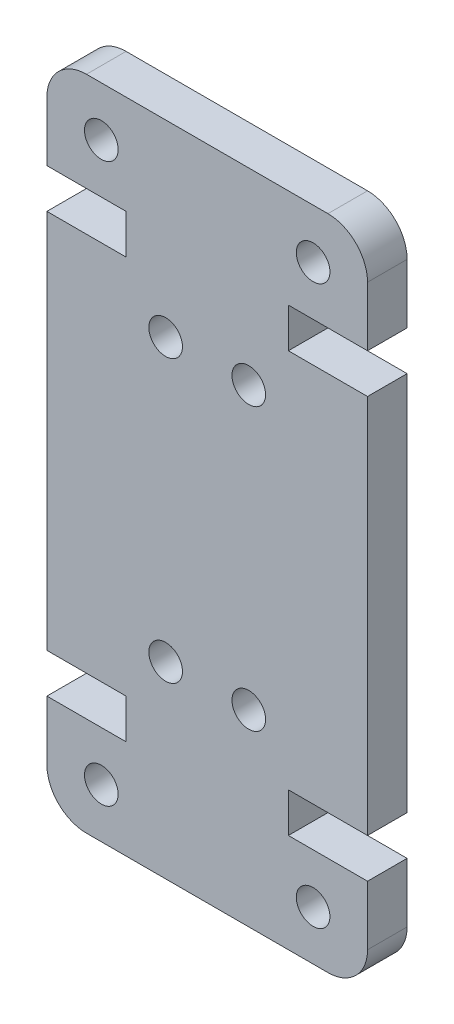
ISO-10303-21;
HEADER;
FILE_DESCRIPTION(('STEP AP214'),'2;1');
FILE_NAME('part.step','',(''),(''),'','','');
FILE_SCHEMA(('AUTOMOTIVE_DESIGN { 1 0 10303 214 1 1 1 1 }'));
ENDSEC;
DATA;
#1=APPLICATION_CONTEXT('core data for automotive mechanical design processes');
#2=APPLICATION_PROTOCOL_DEFINITION('international standard','automotive_design',2000,#1);
#3=PRODUCT_CONTEXT('',#1,'mechanical');
#4=PRODUCT('Part','Part','',(#3));
#5=PRODUCT_RELATED_PRODUCT_CATEGORY('part','',(#4));
#6=PRODUCT_DEFINITION_FORMATION('','',#4);
#7=PRODUCT_DEFINITION_CONTEXT('part definition',#1,'design');
#8=PRODUCT_DEFINITION('design','',#6,#7);
#9=PRODUCT_DEFINITION_SHAPE('','',#8);
#10=(LENGTH_UNIT() NAMED_UNIT(*) SI_UNIT(.MILLI.,.METRE.));
#11=(NAMED_UNIT(*) PLANE_ANGLE_UNIT() SI_UNIT($,.RADIAN.));
#12=(NAMED_UNIT(*) SI_UNIT($,.STERADIAN.) SOLID_ANGLE_UNIT());
#13=UNCERTAINTY_MEASURE_WITH_UNIT(LENGTH_MEASURE(1.E-05),#10,'distance_accuracy_value','');
#14=(GEOMETRIC_REPRESENTATION_CONTEXT(3) GLOBAL_UNCERTAINTY_ASSIGNED_CONTEXT((#13)) GLOBAL_UNIT_ASSIGNED_CONTEXT((#10,
#11,#12)) REPRESENTATION_CONTEXT('',''));
#15=CARTESIAN_POINT('',(0.,0.,0.));
#16=DIRECTION('',(0.,0.,1.));
#17=DIRECTION('',(1.,0.,0.));
#18=AXIS2_PLACEMENT_3D('',#15,#16,#17);
#19=CARTESIAN_POINT('',(2.00000000000001,2.,4.));
#20=DIRECTION('',(0.,0.,1.));
#21=DIRECTION('',(1.,0.,0.));
#22=AXIS2_PLACEMENT_3D('',#19,#20,#21);
#23=PLANE('',#22);
#24=CARTESIAN_POINT('',(10.2,23.7100000000004,4.));
#25=DIRECTION('',(0.,0.,1.));
#26=DIRECTION('',(1.,0.,0.));
#27=AXIS2_PLACEMENT_3D('',#24,#25,#26);
#28=CIRCLE('',#27,0.85);
#29=CARTESIAN_POINT('',(11.05,23.7100000000004,4.));
#30=VERTEX_POINT('',#29);
#31=EDGE_CURVE('E298',#30,#30,#28,.T.);
#32=ORIENTED_EDGE('',*,*,#31,.F.);
#33=EDGE_LOOP('',(#32));
#34=FACE_BOUND('',#33,.T.);
#35=CARTESIAN_POINT('',(6.,9.49999999999962,4.));
#36=DIRECTION('',(0.,0.,1.));
#37=DIRECTION('',(1.,0.,0.));
#38=AXIS2_PLACEMENT_3D('',#35,#36,#37);
#39=CIRCLE('',#38,0.85);
#40=CARTESIAN_POINT('',(6.85,9.49999999999962,4.));
#41=VERTEX_POINT('',#40);
#42=EDGE_CURVE('E304',#41,#41,#39,.T.);
#43=ORIENTED_EDGE('',*,*,#42,.F.);
#44=EDGE_LOOP('',(#43));
#45=FACE_BOUND('',#44,.T.);
#46=CARTESIAN_POINT('',(2.75000000000003,30.7099999999998,4.));
#47=DIRECTION('',(0.,0.,1.));
#48=DIRECTION('',(-1.,0.,0.));
#49=AXIS2_PLACEMENT_3D('',#46,#47,#48);
#50=CIRCLE('',#49,0.85);
#51=CARTESIAN_POINT('',(1.90000000000003,30.7099999999998,4.));
#52=VERTEX_POINT('',#51);
#53=EDGE_CURVE('E310',#52,#52,#50,.T.);
#54=ORIENTED_EDGE('',*,*,#53,.F.);
#55=EDGE_LOOP('',(#54));
#56=FACE_BOUND('',#55,.T.);
#57=CARTESIAN_POINT('',(13.45,2.50000000000017,4.));
#58=DIRECTION('',(0.,0.,1.));
#59=DIRECTION('',(-1.,0.,0.));
#60=AXIS2_PLACEMENT_3D('',#57,#58,#59);
#61=CIRCLE('',#60,0.85);
#62=CARTESIAN_POINT('',(12.6,2.50000000000017,4.));
#63=VERTEX_POINT('',#62);
#64=EDGE_CURVE('E316',#63,#63,#61,.T.);
#65=ORIENTED_EDGE('',*,*,#64,.F.);
#66=EDGE_LOOP('',(#65));
#67=FACE_BOUND('',#66,.T.);
#68=DIRECTION('',(1.,0.,0.));
#69=VECTOR('',#68,1.);
#70=CARTESIAN_POINT('',(0.,6.99999999999946,4.));
#71=LINE('',#70,#69);
#72=CARTESIAN_POINT('',(0.,6.99999999999946,4.));
#73=VERTEX_POINT('',#72);
#74=CARTESIAN_POINT('',(4.00000000000001,6.99999999999946,4.));
#75=VERTEX_POINT('',#74);
#76=EDGE_CURVE('E319',#73,#75,#71,.T.);
#77=ORIENTED_EDGE('',*,*,#76,.T.);
#78=DIRECTION('',(0.,-1.,0.));
#79=VECTOR('',#78,1.);
#80=CARTESIAN_POINT('',(4.00000000000001,6.99999999999946,4.));
#81=LINE('',#80,#79);
#82=CARTESIAN_POINT('',(4.,4.99999999999945,4.));
#83=VERTEX_POINT('',#82);
#84=EDGE_CURVE('E286',#75,#83,#81,.T.);
#85=ORIENTED_EDGE('',*,*,#84,.T.);
#86=DIRECTION('',(-1.,0.,0.));
#87=VECTOR('',#86,1.);
#88=CARTESIAN_POINT('',(4.,4.99999999999945,4.));
#89=LINE('',#88,#87);
#90=CARTESIAN_POINT('',(0.,4.99999999999945,4.));
#91=VERTEX_POINT('',#90);
#92=EDGE_CURVE('E282',#83,#91,#89,.T.);
#93=ORIENTED_EDGE('',*,*,#92,.T.);
#94=DIRECTION('',(0.,-1.,0.));
#95=VECTOR('',#94,1.);
#96=CARTESIAN_POINT('',(0.,2.,4.));
#97=LINE('',#96,#95);
#98=CARTESIAN_POINT('',(0.,2.,4.));
#99=VERTEX_POINT('',#98);
#100=EDGE_CURVE('E323',#91,#99,#97,.T.);
#101=ORIENTED_EDGE('',*,*,#100,.T.);
#102=CARTESIAN_POINT('',(2.00000000000001,2.,4.));
#103=DIRECTION('',(0.,0.,1.));
#104=DIRECTION('',(1.,0.,0.));
#105=AXIS2_PLACEMENT_3D('',#102,#103,#104);
#106=CIRCLE('',#105,2.00000000000001);
#107=CARTESIAN_POINT('',(2.00000000000001,0.,4.));
#108=VERTEX_POINT('',#107);
#109=EDGE_CURVE('E325',#99,#108,#106,.T.);
#110=ORIENTED_EDGE('',*,*,#109,.T.);
#111=DIRECTION('',(1.,0.,0.));
#112=VECTOR('',#111,1.);
#113=CARTESIAN_POINT('',(2.00000000000001,0.,4.));
#114=LINE('',#113,#112);
#115=CARTESIAN_POINT('',(14.2,0.,4.));
#116=VERTEX_POINT('',#115);
#117=EDGE_CURVE('E327',#108,#116,#114,.T.);
#118=ORIENTED_EDGE('',*,*,#117,.T.);
#119=CARTESIAN_POINT('',(14.2,2.,4.));
#120=DIRECTION('',(0.,0.,1.));
#121=DIRECTION('',(-1.,0.,0.));
#122=AXIS2_PLACEMENT_3D('',#119,#120,#121);
#123=CIRCLE('',#122,2.);
#124=CARTESIAN_POINT('',(16.2,2.,4.));
#125=VERTEX_POINT('',#124);
#126=EDGE_CURVE('E329',#116,#125,#123,.T.);
#127=ORIENTED_EDGE('',*,*,#126,.T.);
#128=DIRECTION('',(0.,1.,0.));
#129=VECTOR('',#128,1.);
#130=CARTESIAN_POINT('',(16.2,2.,4.));
#131=LINE('',#130,#129);
#132=CARTESIAN_POINT('',(16.2,4.99999999999945,4.));
#133=VERTEX_POINT('',#132);
#134=EDGE_CURVE('E331',#125,#133,#131,.T.);
#135=ORIENTED_EDGE('',*,*,#134,.T.);
#136=DIRECTION('',(-1.,0.,0.));
#137=VECTOR('',#136,1.);
#138=CARTESIAN_POINT('',(12.2,4.99999999999945,4.));
#139=LINE('',#138,#137);
#140=CARTESIAN_POINT('',(12.2,4.99999999999945,4.));
#141=VERTEX_POINT('',#140);
#142=EDGE_CURVE('E333',#133,#141,#139,.T.);
#143=ORIENTED_EDGE('',*,*,#142,.T.);
#144=DIRECTION('',(0.,1.,0.));
#145=VECTOR('',#144,1.);
#146=CARTESIAN_POINT('',(12.2,6.99999999999945,4.));
#147=LINE('',#146,#145);
#148=CARTESIAN_POINT('',(12.2,6.99999999999945,4.));
#149=VERTEX_POINT('',#148);
#150=EDGE_CURVE('E335',#141,#149,#147,.T.);
#151=ORIENTED_EDGE('',*,*,#150,.T.);
#152=DIRECTION('',(1.,0.,0.));
#153=VECTOR('',#152,1.);
#154=CARTESIAN_POINT('',(16.2,6.99999999999945,4.));
#155=LINE('',#154,#153);
#156=CARTESIAN_POINT('',(16.2,6.99999999999945,4.));
#157=VERTEX_POINT('',#156);
#158=EDGE_CURVE('E337',#149,#157,#155,.T.);
#159=ORIENTED_EDGE('',*,*,#158,.T.);
#160=DIRECTION('',(0.,1.,0.));
#161=VECTOR('',#160,1.);
#162=CARTESIAN_POINT('',(16.2,26.2100000000006,4.));
#163=LINE('',#162,#161);
#164=CARTESIAN_POINT('',(16.2,26.2100000000006,4.));
#165=VERTEX_POINT('',#164);
#166=EDGE_CURVE('E339',#157,#165,#163,.T.);
#167=ORIENTED_EDGE('',*,*,#166,.T.);
#168=DIRECTION('',(-1.,0.,0.));
#169=VECTOR('',#168,1.);
#170=CARTESIAN_POINT('',(16.2,26.2100000000006,4.));
#171=LINE('',#170,#169);
#172=CARTESIAN_POINT('',(12.2,26.2100000000006,4.));
#173=VERTEX_POINT('',#172);
#174=EDGE_CURVE('E341',#165,#173,#171,.T.);
#175=ORIENTED_EDGE('',*,*,#174,.T.);
#176=DIRECTION('',(0.,1.,0.));
#177=VECTOR('',#176,1.);
#178=CARTESIAN_POINT('',(12.2,26.2100000000006,4.));
#179=LINE('',#178,#177);
#180=CARTESIAN_POINT('',(12.2,28.2100000000006,4.));
#181=VERTEX_POINT('',#180);
#182=EDGE_CURVE('E343',#173,#181,#179,.T.);
#183=ORIENTED_EDGE('',*,*,#182,.T.);
#184=DIRECTION('',(1.,0.,0.));
#185=VECTOR('',#184,1.);
#186=CARTESIAN_POINT('',(12.2,28.2100000000006,4.));
#187=LINE('',#186,#185);
#188=CARTESIAN_POINT('',(16.2,28.2100000000006,4.));
#189=VERTEX_POINT('',#188);
#190=EDGE_CURVE('E345',#181,#189,#187,.T.);
#191=ORIENTED_EDGE('',*,*,#190,.T.);
#192=DIRECTION('',(0.,1.,0.));
#193=VECTOR('',#192,1.);
#194=CARTESIAN_POINT('',(16.2,31.21,4.));
#195=LINE('',#194,#193);
#196=CARTESIAN_POINT('',(16.2,31.21,4.));
#197=VERTEX_POINT('',#196);
#198=EDGE_CURVE('E347',#189,#197,#195,.T.);
#199=ORIENTED_EDGE('',*,*,#198,.T.);
#200=CARTESIAN_POINT('',(14.2,31.21,4.));
#201=DIRECTION('',(0.,0.,1.));
#202=DIRECTION('',(1.,0.,0.));
#203=AXIS2_PLACEMENT_3D('',#200,#201,#202);
#204=CIRCLE('',#203,2.);
#205=CARTESIAN_POINT('',(14.2,33.21,4.));
#206=VERTEX_POINT('',#205);
#207=EDGE_CURVE('E349',#197,#206,#204,.T.);
#208=ORIENTED_EDGE('',*,*,#207,.T.);
#209=DIRECTION('',(-1.,0.,0.));
#210=VECTOR('',#209,1.);
#211=CARTESIAN_POINT('',(1.99999999999999,33.21,4.));
#212=LINE('',#211,#210);
#213=CARTESIAN_POINT('',(1.99999999999999,33.21,4.));
#214=VERTEX_POINT('',#213);
#215=EDGE_CURVE('E351',#206,#214,#212,.T.);
#216=ORIENTED_EDGE('',*,*,#215,.T.);
#217=CARTESIAN_POINT('',(1.99999999999999,31.21,4.));
#218=DIRECTION('',(0.,0.,1.));
#219=DIRECTION('',(-1.,0.,0.));
#220=AXIS2_PLACEMENT_3D('',#217,#218,#219);
#221=CIRCLE('',#220,2.);
#222=CARTESIAN_POINT('',(0.,31.21,4.));
#223=VERTEX_POINT('',#222);
#224=EDGE_CURVE('E353',#214,#223,#221,.T.);
#225=ORIENTED_EDGE('',*,*,#224,.T.);
#226=DIRECTION('',(0.,-1.,0.));
#227=VECTOR('',#226,1.);
#228=CARTESIAN_POINT('',(0.,31.21,4.));
#229=LINE('',#228,#227);
#230=CARTESIAN_POINT('',(0.,28.2100000000006,4.));
#231=VERTEX_POINT('',#230);
#232=EDGE_CURVE('E221',#223,#231,#229,.T.);
#233=ORIENTED_EDGE('',*,*,#232,.T.);
#234=DIRECTION('',(1.,0.,0.));
#235=VECTOR('',#234,1.);
#236=CARTESIAN_POINT('',(3.99999999999999,28.2100000000006,4.));
#237=LINE('',#236,#235);
#238=CARTESIAN_POINT('',(3.99999999999999,28.2100000000006,4.));
#239=VERTEX_POINT('',#238);
#240=EDGE_CURVE('E356',#231,#239,#237,.T.);
#241=ORIENTED_EDGE('',*,*,#240,.T.);
#242=DIRECTION('',(0.,-1.,0.));
#243=VECTOR('',#242,1.);
#244=CARTESIAN_POINT('',(3.99999999999999,26.2100000000006,4.));
#245=LINE('',#244,#243);
#246=CARTESIAN_POINT('',(3.99999999999999,26.2100000000006,4.));
#247=VERTEX_POINT('',#246);
#248=EDGE_CURVE('E358',#239,#247,#245,.T.);
#249=ORIENTED_EDGE('',*,*,#248,.T.);
#250=DIRECTION('',(-1.,0.,0.));
#251=VECTOR('',#250,1.);
#252=CARTESIAN_POINT('',(0.,26.2100000000005,4.));
#253=LINE('',#252,#251);
#254=CARTESIAN_POINT('',(0.,26.2100000000005,4.));
#255=VERTEX_POINT('',#254);
#256=EDGE_CURVE('E360',#247,#255,#253,.T.);
#257=ORIENTED_EDGE('',*,*,#256,.T.);
#258=DIRECTION('',(0.,-1.,0.));
#259=VECTOR('',#258,1.);
#260=CARTESIAN_POINT('',(0.,26.2100000000005,4.));
#261=LINE('',#260,#259);
#262=EDGE_CURVE('E57',#255,#73,#261,.T.);
#263=ORIENTED_EDGE('',*,*,#262,.T.);
#264=EDGE_LOOP('',(#77,#85,#93,#101,#110,#118,#127,#135,#143,#151,#159,#167,#175,#183,#191,#199,
#208,#216,#225,#233,#241,#249,#257,#263));
#265=FACE_BOUND('',#264,.T.);
#266=CARTESIAN_POINT('',(10.2,9.49999999999962,4.));
#267=DIRECTION('',(0.,0.,1.));
#268=DIRECTION('',(-1.,0.,0.));
#269=AXIS2_PLACEMENT_3D('',#266,#267,#268);
#270=CIRCLE('',#269,0.85);
#271=CARTESIAN_POINT('',(9.35,9.49999999999962,4.));
#272=VERTEX_POINT('',#271);
#273=EDGE_CURVE('E313',#272,#272,#270,.T.);
#274=ORIENTED_EDGE('',*,*,#273,.F.);
#275=EDGE_LOOP('',(#274));
#276=FACE_BOUND('',#275,.T.);
#277=CARTESIAN_POINT('',(5.99999999999999,23.7100000000004,4.));
#278=DIRECTION('',(0.,0.,1.));
#279=DIRECTION('',(-1.,0.,0.));
#280=AXIS2_PLACEMENT_3D('',#277,#278,#279);
#281=CIRCLE('',#280,0.85);
#282=CARTESIAN_POINT('',(5.15,23.7100000000004,4.));
#283=VERTEX_POINT('',#282);
#284=EDGE_CURVE('E307',#283,#283,#281,.T.);
#285=ORIENTED_EDGE('',*,*,#284,.F.);
#286=EDGE_LOOP('',(#285));
#287=FACE_BOUND('',#286,.T.);
#288=CARTESIAN_POINT('',(2.75000000000004,2.50000000000017,4.));
#289=DIRECTION('',(0.,0.,1.));
#290=DIRECTION('',(1.,0.,0.));
#291=AXIS2_PLACEMENT_3D('',#288,#289,#290);
#292=CIRCLE('',#291,0.85);
#293=CARTESIAN_POINT('',(3.60000000000004,2.50000000000017,4.));
#294=VERTEX_POINT('',#293);
#295=EDGE_CURVE('E301',#294,#294,#292,.T.);
#296=ORIENTED_EDGE('',*,*,#295,.F.);
#297=EDGE_LOOP('',(#296));
#298=FACE_BOUND('',#297,.T.);
#299=CARTESIAN_POINT('',(13.45,30.7099999999998,4.));
#300=DIRECTION('',(0.,0.,1.));
#301=DIRECTION('',(1.,0.,0.));
#302=AXIS2_PLACEMENT_3D('',#299,#300,#301);
#303=CIRCLE('',#302,0.85);
#304=CARTESIAN_POINT('',(14.3,30.7099999999998,4.));
#305=VERTEX_POINT('',#304);
#306=EDGE_CURVE('E290',#305,#305,#303,.T.);
#307=ORIENTED_EDGE('',*,*,#306,.F.);
#308=EDGE_LOOP('',(#307));
#309=FACE_BOUND('',#308,.T.);
#310=ADVANCED_FACE('F33',(#34,#45,#56,#67,#265,#276,#287,#298,#309),#23,.T.);
#311=CARTESIAN_POINT('',(0.,6.99999999999946,4.));
#312=DIRECTION('',(0.,1.,0.));
#313=DIRECTION('',(0.,0.,1.));
#314=AXIS2_PLACEMENT_3D('',#311,#312,#313);
#315=PLANE('',#314);
#316=DIRECTION('',(0.,0.,-1.));
#317=VECTOR('',#316,1.);
#318=CARTESIAN_POINT('',(0.,6.99999999999946,4.));
#319=LINE('',#318,#317);
#320=CARTESIAN_POINT('',(0.,6.99999999999946,2.));
#321=VERTEX_POINT('',#320);
#322=EDGE_CURVE('E363',#73,#321,#319,.T.);
#323=ORIENTED_EDGE('',*,*,#322,.T.);
#324=DIRECTION('',(1.,0.,0.));
#325=VECTOR('',#324,1.);
#326=CARTESIAN_POINT('',(0.,6.99999999999946,2.));
#327=LINE('',#326,#325);
#328=CARTESIAN_POINT('',(4.00000000000001,6.99999999999946,2.));
#329=VERTEX_POINT('',#328);
#330=EDGE_CURVE('E49',#321,#329,#327,.T.);
#331=ORIENTED_EDGE('',*,*,#330,.T.);
#332=DIRECTION('',(0.,0.,-1.));
#333=VECTOR('',#332,1.);
#334=CARTESIAN_POINT('',(4.00000000000001,6.99999999999946,4.));
#335=LINE('',#334,#333);
#336=EDGE_CURVE('E11',#75,#329,#335,.T.);
#337=ORIENTED_EDGE('',*,*,#336,.F.);
#338=ORIENTED_EDGE('',*,*,#76,.F.);
#339=EDGE_LOOP('',(#323,#331,#337,#338));
#340=FACE_BOUND('',#339,.T.);
#341=ADVANCED_FACE('F35',(#340),#315,.F.);
#342=CARTESIAN_POINT('',(4.00000000000001,6.99999999999946,4.));
#343=DIRECTION('',(1.,0.,0.));
#344=DIRECTION('',(0.,1.,0.));
#345=AXIS2_PLACEMENT_3D('',#342,#343,#344);
#346=PLANE('',#345);
#347=ORIENTED_EDGE('',*,*,#336,.T.);
#348=DIRECTION('',(0.,-1.,0.));
#349=VECTOR('',#348,1.);
#350=CARTESIAN_POINT('',(4.00000000000001,6.99999999999946,2.));
#351=LINE('',#350,#349);
#352=CARTESIAN_POINT('',(4.,4.99999999999945,2.));
#353=VERTEX_POINT('',#352);
#354=EDGE_CURVE('E287',#329,#353,#351,.T.);
#355=ORIENTED_EDGE('',*,*,#354,.T.);
#356=DIRECTION('',(0.,0.,-1.));
#357=VECTOR('',#356,1.);
#358=CARTESIAN_POINT('',(4.,4.99999999999945,4.));
#359=LINE('',#358,#357);
#360=EDGE_CURVE('E42',#83,#353,#359,.T.);
#361=ORIENTED_EDGE('',*,*,#360,.F.);
#362=ORIENTED_EDGE('',*,*,#84,.F.);
#363=EDGE_LOOP('',(#347,#355,#361,#362));
#364=FACE_BOUND('',#363,.T.);
#365=ADVANCED_FACE('F285',(#364),#346,.F.);
#366=CARTESIAN_POINT('',(4.,4.99999999999945,4.));
#367=DIRECTION('',(0.,-1.,0.));
#368=DIRECTION('',(0.,0.,-1.));
#369=AXIS2_PLACEMENT_3D('',#366,#367,#368);
#370=PLANE('',#369);
#371=ORIENTED_EDGE('',*,*,#360,.T.);
#372=DIRECTION('',(-1.,0.,0.));
#373=VECTOR('',#372,1.);
#374=CARTESIAN_POINT('',(4.,4.99999999999945,2.));
#375=LINE('',#374,#373);
#376=CARTESIAN_POINT('',(0.,4.99999999999945,2.));
#377=VERTEX_POINT('',#376);
#378=EDGE_CURVE('E281',#353,#377,#375,.T.);
#379=ORIENTED_EDGE('',*,*,#378,.T.);
#380=DIRECTION('',(0.,0.,-1.));
#381=VECTOR('',#380,1.);
#382=CARTESIAN_POINT('',(0.,4.99999999999945,4.));
#383=LINE('',#382,#381);
#384=EDGE_CURVE('E271',#91,#377,#383,.T.);
#385=ORIENTED_EDGE('',*,*,#384,.F.);
#386=ORIENTED_EDGE('',*,*,#92,.F.);
#387=EDGE_LOOP('',(#371,#379,#385,#386));
#388=FACE_BOUND('',#387,.T.);
#389=ADVANCED_FACE('F279',(#388),#370,.F.);
#390=CARTESIAN_POINT('',(0.,2.,4.));
#391=DIRECTION('',(1.,0.,0.));
#392=DIRECTION('',(0.,0.,-1.));
#393=AXIS2_PLACEMENT_3D('',#390,#391,#392);
#394=PLANE('',#393);
#395=ORIENTED_EDGE('',*,*,#384,.T.);
#396=DIRECTION('',(0.,-1.,0.));
#397=VECTOR('',#396,1.);
#398=CARTESIAN_POINT('',(0.,33.21,2.));
#399=LINE('',#398,#397);
#400=CARTESIAN_POINT('',(0.,2.,2.));
#401=VERTEX_POINT('',#400);
#402=EDGE_CURVE('E208',#377,#401,#399,.T.);
#403=ORIENTED_EDGE('',*,*,#402,.T.);
#404=DIRECTION('',(0.,0.,-1.));
#405=VECTOR('',#404,1.);
#406=CARTESIAN_POINT('',(0.,2.,4.));
#407=LINE('',#406,#405);
#408=EDGE_CURVE('E268',#99,#401,#407,.T.);
#409=ORIENTED_EDGE('',*,*,#408,.F.);
#410=ORIENTED_EDGE('',*,*,#100,.F.);
#411=EDGE_LOOP('',(#395,#403,#409,#410));
#412=FACE_BOUND('',#411,.T.);
#413=ADVANCED_FACE('F426',(#412),#394,.F.);
#414=CARTESIAN_POINT('',(2.00000000000001,2.,4.));
#415=DIRECTION('',(0.,0.,-1.));
#416=DIRECTION('',(-1.,0.,0.));
#417=AXIS2_PLACEMENT_3D('',#414,#415,#416);
#418=CYLINDRICAL_SURFACE('',#417,2.00000000000001);
#419=ORIENTED_EDGE('',*,*,#408,.T.);
#420=CARTESIAN_POINT('',(2.00000000000001,2.,2.));
#421=DIRECTION('',(0.,0.,1.));
#422=DIRECTION('',(1.,0.,0.));
#423=AXIS2_PLACEMENT_3D('',#420,#421,#422);
#424=CIRCLE('',#423,2.00000000000001);
#425=CARTESIAN_POINT('',(2.00000000000001,0.,2.));
#426=VERTEX_POINT('',#425);
#427=EDGE_CURVE('E292',#401,#426,#424,.T.);
#428=ORIENTED_EDGE('',*,*,#427,.T.);
#429=DIRECTION('',(0.,0.,-1.));
#430=VECTOR('',#429,1.);
#431=CARTESIAN_POINT('',(2.00000000000001,0.,4.));
#432=LINE('',#431,#430);
#433=EDGE_CURVE('E265',#108,#426,#432,.T.);
#434=ORIENTED_EDGE('',*,*,#433,.F.);
#435=ORIENTED_EDGE('',*,*,#109,.F.);
#436=EDGE_LOOP('',(#419,#428,#434,#435));
#437=FACE_BOUND('',#436,.T.);
#438=ADVANCED_FACE('F412',(#437),#418,.T.);
#439=CARTESIAN_POINT('',(2.00000000000001,0.,4.));
#440=DIRECTION('',(0.,1.,0.));
#441=DIRECTION('',(-1.,0.,0.));
#442=AXIS2_PLACEMENT_3D('',#439,#440,#441);
#443=PLANE('',#442);
#444=ORIENTED_EDGE('',*,*,#433,.T.);
#445=DIRECTION('',(1.,0.,0.));
#446=VECTOR('',#445,1.);
#447=CARTESIAN_POINT('',(0.,0.,2.));
#448=LINE('',#447,#446);
#449=CARTESIAN_POINT('',(14.2,0.,2.));
#450=VERTEX_POINT('',#449);
#451=EDGE_CURVE('E205',#426,#450,#448,.T.);
#452=ORIENTED_EDGE('',*,*,#451,.T.);
#453=DIRECTION('',(0.,0.,-1.));
#454=VECTOR('',#453,1.);
#455=CARTESIAN_POINT('',(14.2,0.,4.));
#456=LINE('',#455,#454);
#457=EDGE_CURVE('E262',#116,#450,#456,.T.);
#458=ORIENTED_EDGE('',*,*,#457,.F.);
#459=ORIENTED_EDGE('',*,*,#117,.F.);
#460=EDGE_LOOP('',(#444,#452,#458,#459));
#461=FACE_BOUND('',#460,.T.);
#462=ADVANCED_FACE('F419',(#461),#443,.F.);
#463=CARTESIAN_POINT('',(14.2,2.,4.));
#464=DIRECTION('',(0.,0.,-1.));
#465=DIRECTION('',(-1.,0.,0.));
#466=AXIS2_PLACEMENT_3D('',#463,#464,#465);
#467=CYLINDRICAL_SURFACE('',#466,2.);
#468=ORIENTED_EDGE('',*,*,#457,.T.);
#469=CARTESIAN_POINT('',(14.2,2.,2.));
#470=DIRECTION('',(0.,0.,1.));
#471=DIRECTION('',(1.,0.,0.));
#472=AXIS2_PLACEMENT_3D('',#469,#470,#471);
#473=CIRCLE('',#472,2.);
#474=CARTESIAN_POINT('',(16.2,2.,2.));
#475=VERTEX_POINT('',#474);
#476=EDGE_CURVE('E407',#450,#475,#473,.T.);
#477=ORIENTED_EDGE('',*,*,#476,.T.);
#478=DIRECTION('',(0.,0.,-1.));
#479=VECTOR('',#478,1.);
#480=CARTESIAN_POINT('',(16.2,2.,4.));
#481=LINE('',#480,#479);
#482=EDGE_CURVE('E259',#125,#475,#481,.T.);
#483=ORIENTED_EDGE('',*,*,#482,.F.);
#484=ORIENTED_EDGE('',*,*,#126,.F.);
#485=EDGE_LOOP('',(#468,#477,#483,#484));
#486=FACE_BOUND('',#485,.T.);
#487=ADVANCED_FACE('F535',(#486),#467,.T.);
#488=CARTESIAN_POINT('',(16.2,2.,4.));
#489=DIRECTION('',(-1.,0.,0.));
#490=DIRECTION('',(0.,0.,1.));
#491=AXIS2_PLACEMENT_3D('',#488,#489,#490);
#492=PLANE('',#491);
#493=ORIENTED_EDGE('',*,*,#482,.T.);
#494=DIRECTION('',(0.,1.,0.));
#495=VECTOR('',#494,1.);
#496=CARTESIAN_POINT('',(16.2,0.,2.));
#497=LINE('',#496,#495);
#498=CARTESIAN_POINT('',(16.2,4.99999999999945,2.));
#499=VERTEX_POINT('',#498);
#500=EDGE_CURVE('E433',#475,#499,#497,.T.);
#501=ORIENTED_EDGE('',*,*,#500,.T.);
#502=DIRECTION('',(0.,0.,-1.));
#503=VECTOR('',#502,1.);
#504=CARTESIAN_POINT('',(16.2,4.99999999999945,4.));
#505=LINE('',#504,#503);
#506=EDGE_CURVE('E256',#133,#499,#505,.T.);
#507=ORIENTED_EDGE('',*,*,#506,.F.);
#508=ORIENTED_EDGE('',*,*,#134,.F.);
#509=EDGE_LOOP('',(#493,#501,#507,#508));
#510=FACE_BOUND('',#509,.T.);
#511=ADVANCED_FACE('F531',(#510),#492,.F.);
#512=CARTESIAN_POINT('',(12.2,4.99999999999945,4.));
#513=DIRECTION('',(0.,-1.,0.));
#514=DIRECTION('',(0.,0.,-1.));
#515=AXIS2_PLACEMENT_3D('',#512,#513,#514);
#516=PLANE('',#515);
#517=ORIENTED_EDGE('',*,*,#506,.T.);
#518=DIRECTION('',(-1.,0.,0.));
#519=VECTOR('',#518,1.);
#520=CARTESIAN_POINT('',(12.2,4.99999999999945,2.));
#521=LINE('',#520,#519);
#522=CARTESIAN_POINT('',(12.2,4.99999999999945,2.));
#523=VERTEX_POINT('',#522);
#524=EDGE_CURVE('E404',#499,#523,#521,.T.);
#525=ORIENTED_EDGE('',*,*,#524,.T.);
#526=DIRECTION('',(0.,0.,-1.));
#527=VECTOR('',#526,1.);
#528=CARTESIAN_POINT('',(12.2,4.99999999999945,4.));
#529=LINE('',#528,#527);
#530=EDGE_CURVE('E253',#141,#523,#529,.T.);
#531=ORIENTED_EDGE('',*,*,#530,.F.);
#532=ORIENTED_EDGE('',*,*,#142,.F.);
#533=EDGE_LOOP('',(#517,#525,#531,#532));
#534=FACE_BOUND('',#533,.T.);
#535=ADVANCED_FACE('F527',(#534),#516,.F.);
#536=CARTESIAN_POINT('',(12.2,6.99999999999945,4.));
#537=DIRECTION('',(-1.,0.,0.));
#538=DIRECTION('',(0.,0.,1.));
#539=AXIS2_PLACEMENT_3D('',#536,#537,#538);
#540=PLANE('',#539);
#541=ORIENTED_EDGE('',*,*,#530,.T.);
#542=DIRECTION('',(0.,1.,0.));
#543=VECTOR('',#542,1.);
#544=CARTESIAN_POINT('',(12.2,6.99999999999945,2.));
#545=LINE('',#544,#543);
#546=CARTESIAN_POINT('',(12.2,6.99999999999945,2.));
#547=VERTEX_POINT('',#546);
#548=EDGE_CURVE('E401',#523,#547,#545,.T.);
#549=ORIENTED_EDGE('',*,*,#548,.T.);
#550=DIRECTION('',(0.,0.,-1.));
#551=VECTOR('',#550,1.);
#552=CARTESIAN_POINT('',(12.2,6.99999999999945,4.));
#553=LINE('',#552,#551);
#554=EDGE_CURVE('E250',#149,#547,#553,.T.);
#555=ORIENTED_EDGE('',*,*,#554,.F.);
#556=ORIENTED_EDGE('',*,*,#150,.F.);
#557=EDGE_LOOP('',(#541,#549,#555,#556));
#558=FACE_BOUND('',#557,.T.);
#559=ADVANCED_FACE('F523',(#558),#540,.F.);
#560=CARTESIAN_POINT('',(16.2,6.99999999999945,4.));
#561=DIRECTION('',(0.,1.,0.));
#562=DIRECTION('',(-1.,0.,0.));
#563=AXIS2_PLACEMENT_3D('',#560,#561,#562);
#564=PLANE('',#563);
#565=ORIENTED_EDGE('',*,*,#554,.T.);
#566=DIRECTION('',(1.,0.,0.));
#567=VECTOR('',#566,1.);
#568=CARTESIAN_POINT('',(16.2,6.99999999999945,2.));
#569=LINE('',#568,#567);
#570=CARTESIAN_POINT('',(16.2,6.99999999999945,2.));
#571=VERTEX_POINT('',#570);
#572=EDGE_CURVE('E398',#547,#571,#569,.T.);
#573=ORIENTED_EDGE('',*,*,#572,.T.);
#574=DIRECTION('',(0.,0.,-1.));
#575=VECTOR('',#574,1.);
#576=CARTESIAN_POINT('',(16.2,6.99999999999945,4.));
#577=LINE('',#576,#575);
#578=EDGE_CURVE('E247',#157,#571,#577,.T.);
#579=ORIENTED_EDGE('',*,*,#578,.F.);
#580=ORIENTED_EDGE('',*,*,#158,.F.);
#581=EDGE_LOOP('',(#565,#573,#579,#580));
#582=FACE_BOUND('',#581,.T.);
#583=ADVANCED_FACE('F519',(#582),#564,.F.);
#584=CARTESIAN_POINT('',(16.2,26.2100000000006,4.));
#585=DIRECTION('',(-1.,0.,0.));
#586=DIRECTION('',(0.,0.,1.));
#587=AXIS2_PLACEMENT_3D('',#584,#585,#586);
#588=PLANE('',#587);
#589=ORIENTED_EDGE('',*,*,#578,.T.);
#590=CARTESIAN_POINT('',(16.2,26.2100000000006,2.));
#591=VERTEX_POINT('',#590);
#592=EDGE_CURVE('E432',#571,#591,#497,.T.);
#593=ORIENTED_EDGE('',*,*,#592,.T.);
#594=DIRECTION('',(0.,0.,-1.));
#595=VECTOR('',#594,1.);
#596=CARTESIAN_POINT('',(16.2,26.2100000000006,4.));
#597=LINE('',#596,#595);
#598=EDGE_CURVE('E244',#165,#591,#597,.T.);
#599=ORIENTED_EDGE('',*,*,#598,.F.);
#600=ORIENTED_EDGE('',*,*,#166,.F.);
#601=EDGE_LOOP('',(#589,#593,#599,#600));
#602=FACE_BOUND('',#601,.T.);
#603=ADVANCED_FACE('F515',(#602),#588,.F.);
#604=CARTESIAN_POINT('',(16.2,26.2100000000006,4.));
#605=DIRECTION('',(0.,-1.,0.));
#606=DIRECTION('',(0.,0.,-1.));
#607=AXIS2_PLACEMENT_3D('',#604,#605,#606);
#608=PLANE('',#607);
#609=ORIENTED_EDGE('',*,*,#598,.T.);
#610=DIRECTION('',(-1.,0.,0.));
#611=VECTOR('',#610,1.);
#612=CARTESIAN_POINT('',(16.2,26.2100000000006,2.));
#613=LINE('',#612,#611);
#614=CARTESIAN_POINT('',(12.2,26.2100000000006,2.));
#615=VERTEX_POINT('',#614);
#616=EDGE_CURVE('E395',#591,#615,#613,.T.);
#617=ORIENTED_EDGE('',*,*,#616,.T.);
#618=DIRECTION('',(0.,0.,-1.));
#619=VECTOR('',#618,1.);
#620=CARTESIAN_POINT('',(12.2,26.2100000000006,4.));
#621=LINE('',#620,#619);
#622=EDGE_CURVE('E241',#173,#615,#621,.T.);
#623=ORIENTED_EDGE('',*,*,#622,.F.);
#624=ORIENTED_EDGE('',*,*,#174,.F.);
#625=EDGE_LOOP('',(#609,#617,#623,#624));
#626=FACE_BOUND('',#625,.T.);
#627=ADVANCED_FACE('F511',(#626),#608,.F.);
#628=CARTESIAN_POINT('',(12.2,26.2100000000006,4.));
#629=DIRECTION('',(-1.,0.,0.));
#630=DIRECTION('',(0.,0.,1.));
#631=AXIS2_PLACEMENT_3D('',#628,#629,#630);
#632=PLANE('',#631);
#633=ORIENTED_EDGE('',*,*,#622,.T.);
#634=DIRECTION('',(0.,1.,0.));
#635=VECTOR('',#634,1.);
#636=CARTESIAN_POINT('',(12.2,26.2100000000006,2.));
#637=LINE('',#636,#635);
#638=CARTESIAN_POINT('',(12.2,28.2100000000006,2.));
#639=VERTEX_POINT('',#638);
#640=EDGE_CURVE('E392',#615,#639,#637,.T.);
#641=ORIENTED_EDGE('',*,*,#640,.T.);
#642=DIRECTION('',(0.,0.,-1.));
#643=VECTOR('',#642,1.);
#644=CARTESIAN_POINT('',(12.2,28.2100000000006,4.));
#645=LINE('',#644,#643);
#646=EDGE_CURVE('E238',#181,#639,#645,.T.);
#647=ORIENTED_EDGE('',*,*,#646,.F.);
#648=ORIENTED_EDGE('',*,*,#182,.F.);
#649=EDGE_LOOP('',(#633,#641,#647,#648));
#650=FACE_BOUND('',#649,.T.);
#651=ADVANCED_FACE('F507',(#650),#632,.F.);
#652=CARTESIAN_POINT('',(12.2,28.2100000000006,4.));
#653=DIRECTION('',(0.,1.,0.));
#654=DIRECTION('',(0.,0.,1.));
#655=AXIS2_PLACEMENT_3D('',#652,#653,#654);
#656=PLANE('',#655);
#657=ORIENTED_EDGE('',*,*,#646,.T.);
#658=DIRECTION('',(1.,0.,0.));
#659=VECTOR('',#658,1.);
#660=CARTESIAN_POINT('',(12.2,28.2100000000006,2.));
#661=LINE('',#660,#659);
#662=CARTESIAN_POINT('',(16.2,28.2100000000006,2.));
#663=VERTEX_POINT('',#662);
#664=EDGE_CURVE('E389',#639,#663,#661,.T.);
#665=ORIENTED_EDGE('',*,*,#664,.T.);
#666=DIRECTION('',(0.,0.,-1.));
#667=VECTOR('',#666,1.);
#668=CARTESIAN_POINT('',(16.2,28.2100000000006,4.));
#669=LINE('',#668,#667);
#670=EDGE_CURVE('E235',#189,#663,#669,.T.);
#671=ORIENTED_EDGE('',*,*,#670,.F.);
#672=ORIENTED_EDGE('',*,*,#190,.F.);
#673=EDGE_LOOP('',(#657,#665,#671,#672));
#674=FACE_BOUND('',#673,.T.);
#675=ADVANCED_FACE('F503',(#674),#656,.F.);
#676=CARTESIAN_POINT('',(16.2,31.21,4.));
#677=DIRECTION('',(-1.,0.,0.));
#678=DIRECTION('',(0.,0.,1.));
#679=AXIS2_PLACEMENT_3D('',#676,#677,#678);
#680=PLANE('',#679);
#681=ORIENTED_EDGE('',*,*,#670,.T.);
#682=CARTESIAN_POINT('',(16.2,31.21,2.));
#683=VERTEX_POINT('',#682);
#684=EDGE_CURVE('E429',#663,#683,#497,.T.);
#685=ORIENTED_EDGE('',*,*,#684,.T.);
#686=DIRECTION('',(0.,0.,-1.));
#687=VECTOR('',#686,1.);
#688=CARTESIAN_POINT('',(16.2,31.21,4.));
#689=LINE('',#688,#687);
#690=EDGE_CURVE('E232',#197,#683,#689,.T.);
#691=ORIENTED_EDGE('',*,*,#690,.F.);
#692=ORIENTED_EDGE('',*,*,#198,.F.);
#693=EDGE_LOOP('',(#681,#685,#691,#692));
#694=FACE_BOUND('',#693,.T.);
#695=ADVANCED_FACE('F499',(#694),#680,.F.);
#696=CARTESIAN_POINT('',(14.2,31.21,4.));
#697=DIRECTION('',(0.,0.,-1.));
#698=DIRECTION('',(-1.,0.,0.));
#699=AXIS2_PLACEMENT_3D('',#696,#697,#698);
#700=CYLINDRICAL_SURFACE('',#699,2.);
#701=ORIENTED_EDGE('',*,*,#690,.T.);
#702=CARTESIAN_POINT('',(14.2,31.21,2.));
#703=DIRECTION('',(0.,0.,1.));
#704=DIRECTION('',(1.,0.,0.));
#705=AXIS2_PLACEMENT_3D('',#702,#703,#704);
#706=CIRCLE('',#705,2.);
#707=CARTESIAN_POINT('',(14.2,33.21,2.));
#708=VERTEX_POINT('',#707);
#709=EDGE_CURVE('E218',#683,#708,#706,.T.);
#710=ORIENTED_EDGE('',*,*,#709,.T.);
#711=DIRECTION('',(0.,0.,-1.));
#712=VECTOR('',#711,1.);
#713=CARTESIAN_POINT('',(14.2,33.21,4.));
#714=LINE('',#713,#712);
#715=EDGE_CURVE('E224',#206,#708,#714,.T.);
#716=ORIENTED_EDGE('',*,*,#715,.F.);
#717=ORIENTED_EDGE('',*,*,#207,.F.);
#718=EDGE_LOOP('',(#701,#710,#716,#717));
#719=FACE_BOUND('',#718,.T.);
#720=ADVANCED_FACE('F495',(#719),#700,.T.);
#721=CARTESIAN_POINT('',(1.99999999999999,33.21,4.));
#722=DIRECTION('',(0.,-1.,0.));
#723=DIRECTION('',(0.,0.,-1.));
#724=AXIS2_PLACEMENT_3D('',#721,#722,#723);
#725=PLANE('',#724);
#726=ORIENTED_EDGE('',*,*,#715,.T.);
#727=DIRECTION('',(-1.,0.,0.));
#728=VECTOR('',#727,1.);
#729=CARTESIAN_POINT('',(16.2,33.21,2.));
#730=LINE('',#729,#728);
#731=CARTESIAN_POINT('',(1.99999999999999,33.21,2.));
#732=VERTEX_POINT('',#731);
#733=EDGE_CURVE('E434',#708,#732,#730,.T.);
#734=ORIENTED_EDGE('',*,*,#733,.T.);
#735=DIRECTION('',(0.,0.,-1.));
#736=VECTOR('',#735,1.);
#737=CARTESIAN_POINT('',(1.99999999999999,33.21,4.));
#738=LINE('',#737,#736);
#739=EDGE_CURVE('E217',#214,#732,#738,.T.);
#740=ORIENTED_EDGE('',*,*,#739,.F.);
#741=ORIENTED_EDGE('',*,*,#215,.F.);
#742=EDGE_LOOP('',(#726,#734,#740,#741));
#743=FACE_BOUND('',#742,.T.);
#744=ADVANCED_FACE('F492',(#743),#725,.F.);
#745=CARTESIAN_POINT('',(1.99999999999999,31.21,4.));
#746=DIRECTION('',(0.,0.,-1.));
#747=DIRECTION('',(-1.,0.,0.));
#748=AXIS2_PLACEMENT_3D('',#745,#746,#747);
#749=CYLINDRICAL_SURFACE('',#748,2.);
#750=ORIENTED_EDGE('',*,*,#739,.T.);
#751=CARTESIAN_POINT('',(1.99999999999999,31.21,2.));
#752=DIRECTION('',(0.,0.,1.));
#753=DIRECTION('',(1.,0.,0.));
#754=AXIS2_PLACEMENT_3D('',#751,#752,#753);
#755=CIRCLE('',#754,2.);
#756=CARTESIAN_POINT('',(0.,31.21,2.));
#757=VERTEX_POINT('',#756);
#758=EDGE_CURVE('E197',#732,#757,#755,.T.);
#759=ORIENTED_EDGE('',*,*,#758,.T.);
#760=DIRECTION('',(0.,0.,-1.));
#761=VECTOR('',#760,1.);
#762=CARTESIAN_POINT('',(0.,31.21,4.));
#763=LINE('',#762,#761);
#764=EDGE_CURVE('E214',#223,#757,#763,.T.);
#765=ORIENTED_EDGE('',*,*,#764,.F.);
#766=ORIENTED_EDGE('',*,*,#224,.F.);
#767=EDGE_LOOP('',(#750,#759,#765,#766));
#768=FACE_BOUND('',#767,.T.);
#769=ADVANCED_FACE('F212',(#768),#749,.T.);
#770=CARTESIAN_POINT('',(0.,31.21,4.));
#771=DIRECTION('',(1.,0.,0.));
#772=DIRECTION('',(0.,1.,0.));
#773=AXIS2_PLACEMENT_3D('',#770,#771,#772);
#774=PLANE('',#773);
#775=ORIENTED_EDGE('',*,*,#764,.T.);
#776=CARTESIAN_POINT('',(0.,28.2100000000006,2.));
#777=VERTEX_POINT('',#776);
#778=EDGE_CURVE('E194',#757,#777,#399,.T.);
#779=ORIENTED_EDGE('',*,*,#778,.T.);
#780=DIRECTION('',(0.,0.,-1.));
#781=VECTOR('',#780,1.);
#782=CARTESIAN_POINT('',(0.,28.2100000000006,4.));
#783=LINE('',#782,#781);
#784=EDGE_CURVE('E222',#231,#777,#783,.T.);
#785=ORIENTED_EDGE('',*,*,#784,.F.);
#786=ORIENTED_EDGE('',*,*,#232,.F.);
#787=EDGE_LOOP('',(#775,#779,#785,#786));
#788=FACE_BOUND('',#787,.T.);
#789=ADVANCED_FACE('F220',(#788),#774,.F.);
#790=CARTESIAN_POINT('',(3.99999999999999,28.2100000000006,4.));
#791=DIRECTION('',(0.,1.,0.));
#792=DIRECTION('',(-1.,0.,0.));
#793=AXIS2_PLACEMENT_3D('',#790,#791,#792);
#794=PLANE('',#793);
#795=ORIENTED_EDGE('',*,*,#784,.T.);
#796=DIRECTION('',(1.,0.,0.));
#797=VECTOR('',#796,1.);
#798=CARTESIAN_POINT('',(3.99999999999999,28.2100000000006,2.));
#799=LINE('',#798,#797);
#800=CARTESIAN_POINT('',(3.99999999999999,28.2100000000006,2.));
#801=VERTEX_POINT('',#800);
#802=EDGE_CURVE('E200',#777,#801,#799,.T.);
#803=ORIENTED_EDGE('',*,*,#802,.T.);
#804=DIRECTION('',(0.,0.,-1.));
#805=VECTOR('',#804,1.);
#806=CARTESIAN_POINT('',(3.99999999999999,28.2100000000006,4.));
#807=LINE('',#806,#805);
#808=EDGE_CURVE('E226',#239,#801,#807,.T.);
#809=ORIENTED_EDGE('',*,*,#808,.F.);
#810=ORIENTED_EDGE('',*,*,#240,.F.);
#811=EDGE_LOOP('',(#795,#803,#809,#810));
#812=FACE_BOUND('',#811,.T.);
#813=ADVANCED_FACE('F381',(#812),#794,.F.);
#814=CARTESIAN_POINT('',(3.99999999999999,26.2100000000006,4.));
#815=DIRECTION('',(1.,0.,0.));
#816=DIRECTION('',(0.,1.,0.));
#817=AXIS2_PLACEMENT_3D('',#814,#815,#816);
#818=PLANE('',#817);
#819=ORIENTED_EDGE('',*,*,#808,.T.);
#820=DIRECTION('',(0.,-1.,0.));
#821=VECTOR('',#820,1.);
#822=CARTESIAN_POINT('',(3.99999999999999,26.2100000000006,2.));
#823=LINE('',#822,#821);
#824=CARTESIAN_POINT('',(3.99999999999999,26.2100000000006,2.));
#825=VERTEX_POINT('',#824);
#826=EDGE_CURVE('E378',#801,#825,#823,.T.);
#827=ORIENTED_EDGE('',*,*,#826,.T.);
#828=DIRECTION('',(0.,0.,-1.));
#829=VECTOR('',#828,1.);
#830=CARTESIAN_POINT('',(3.99999999999999,26.2100000000006,4.));
#831=LINE('',#830,#829);
#832=EDGE_CURVE('E369',#247,#825,#831,.T.);
#833=ORIENTED_EDGE('',*,*,#832,.F.);
#834=ORIENTED_EDGE('',*,*,#248,.F.);
#835=EDGE_LOOP('',(#819,#827,#833,#834));
#836=FACE_BOUND('',#835,.T.);
#837=ADVANCED_FACE('F376',(#836),#818,.F.);
#838=CARTESIAN_POINT('',(0.,26.2100000000005,4.));
#839=DIRECTION('',(0.,-1.,0.));
#840=DIRECTION('',(1.,0.,0.));
#841=AXIS2_PLACEMENT_3D('',#838,#839,#840);
#842=PLANE('',#841);
#843=ORIENTED_EDGE('',*,*,#832,.T.);
#844=DIRECTION('',(-1.,0.,0.));
#845=VECTOR('',#844,1.);
#846=CARTESIAN_POINT('',(0.,26.2100000000005,2.));
#847=LINE('',#846,#845);
#848=CARTESIAN_POINT('',(0.,26.2100000000005,2.));
#849=VERTEX_POINT('',#848);
#850=EDGE_CURVE('E383',#825,#849,#847,.T.);
#851=ORIENTED_EDGE('',*,*,#850,.T.);
#852=DIRECTION('',(0.,0.,-1.));
#853=VECTOR('',#852,1.);
#854=CARTESIAN_POINT('',(0.,26.2100000000005,4.));
#855=LINE('',#854,#853);
#856=EDGE_CURVE('E366',#255,#849,#855,.T.);
#857=ORIENTED_EDGE('',*,*,#856,.F.);
#858=ORIENTED_EDGE('',*,*,#256,.F.);
#859=EDGE_LOOP('',(#843,#851,#857,#858));
#860=FACE_BOUND('',#859,.T.);
#861=ADVANCED_FACE('F459',(#860),#842,.F.);
#862=CARTESIAN_POINT('',(0.,26.2100000000005,4.));
#863=DIRECTION('',(1.,0.,0.));
#864=DIRECTION('',(0.,1.,0.));
#865=AXIS2_PLACEMENT_3D('',#862,#863,#864);
#866=PLANE('',#865);
#867=ORIENTED_EDGE('',*,*,#856,.T.);
#868=EDGE_CURVE('E206',#849,#321,#399,.T.);
#869=ORIENTED_EDGE('',*,*,#868,.T.);
#870=ORIENTED_EDGE('',*,*,#322,.F.);
#871=ORIENTED_EDGE('',*,*,#262,.F.);
#872=EDGE_LOOP('',(#867,#869,#870,#871));
#873=FACE_BOUND('',#872,.T.);
#874=ADVANCED_FACE('F462',(#873),#866,.F.);
#875=CARTESIAN_POINT('',(13.45,2.50000000000017,4.));
#876=DIRECTION('',(0.,0.,-1.));
#877=DIRECTION('',(-1.,0.,0.));
#878=AXIS2_PLACEMENT_3D('',#875,#876,#877);
#879=CYLINDRICAL_SURFACE('',#878,0.85);
#880=CARTESIAN_POINT('',(13.45,2.50000000000017,2.));
#881=DIRECTION('',(0.,0.,1.));
#882=DIRECTION('',(1.,0.,0.));
#883=AXIS2_PLACEMENT_3D('',#880,#881,#882);
#884=CIRCLE('',#883,0.85);
#885=CARTESIAN_POINT('',(14.3,2.50000000000017,2.));
#886=VERTEX_POINT('',#885);
#887=EDGE_CURVE('E454',#886,#886,#884,.T.);
#888=ORIENTED_EDGE('',*,*,#887,.F.);
#889=EDGE_LOOP('',(#888));
#890=FACE_BOUND('',#889,.T.);
#891=ORIENTED_EDGE('',*,*,#64,.T.);
#892=EDGE_LOOP('',(#891));
#893=FACE_BOUND('',#892,.T.);
#894=ADVANCED_FACE('F478',(#890,#893),#879,.F.);
#895=CARTESIAN_POINT('',(10.2,9.49999999999962,4.));
#896=DIRECTION('',(0.,0.,-1.));
#897=DIRECTION('',(-1.,0.,0.));
#898=AXIS2_PLACEMENT_3D('',#895,#896,#897);
#899=CYLINDRICAL_SURFACE('',#898,0.85);
#900=CARTESIAN_POINT('',(10.2,9.49999999999962,2.));
#901=DIRECTION('',(0.,0.,1.));
#902=DIRECTION('',(1.,0.,0.));
#903=AXIS2_PLACEMENT_3D('',#900,#901,#902);
#904=CIRCLE('',#903,0.85);
#905=CARTESIAN_POINT('',(11.05,9.49999999999962,2.));
#906=VERTEX_POINT('',#905);
#907=EDGE_CURVE('E451',#906,#906,#904,.T.);
#908=ORIENTED_EDGE('',*,*,#907,.F.);
#909=EDGE_LOOP('',(#908));
#910=FACE_BOUND('',#909,.T.);
#911=ORIENTED_EDGE('',*,*,#273,.T.);
#912=EDGE_LOOP('',(#911));
#913=FACE_BOUND('',#912,.T.);
#914=ADVANCED_FACE('F641',(#910,#913),#899,.F.);
#915=CARTESIAN_POINT('',(2.75000000000003,30.7099999999998,4.));
#916=DIRECTION('',(0.,0.,-1.));
#917=DIRECTION('',(-1.,0.,0.));
#918=AXIS2_PLACEMENT_3D('',#915,#916,#917);
#919=CYLINDRICAL_SURFACE('',#918,0.85);
#920=CARTESIAN_POINT('',(2.75000000000003,30.7099999999998,2.));
#921=DIRECTION('',(0.,0.,1.));
#922=DIRECTION('',(1.,0.,0.));
#923=AXIS2_PLACEMENT_3D('',#920,#921,#922);
#924=CIRCLE('',#923,0.85);
#925=CARTESIAN_POINT('',(3.60000000000003,30.7099999999998,2.));
#926=VERTEX_POINT('',#925);
#927=EDGE_CURVE('E448',#926,#926,#924,.T.);
#928=ORIENTED_EDGE('',*,*,#927,.F.);
#929=EDGE_LOOP('',(#928));
#930=FACE_BOUND('',#929,.T.);
#931=ORIENTED_EDGE('',*,*,#53,.T.);
#932=EDGE_LOOP('',(#931));
#933=FACE_BOUND('',#932,.T.);
#934=ADVANCED_FACE('F648',(#930,#933),#919,.F.);
#935=CARTESIAN_POINT('',(5.99999999999999,23.7100000000004,4.));
#936=DIRECTION('',(0.,0.,-1.));
#937=DIRECTION('',(-1.,0.,0.));
#938=AXIS2_PLACEMENT_3D('',#935,#936,#937);
#939=CYLINDRICAL_SURFACE('',#938,0.85);
#940=CARTESIAN_POINT('',(5.99999999999999,23.7100000000004,2.));
#941=DIRECTION('',(0.,0.,1.));
#942=DIRECTION('',(1.,0.,0.));
#943=AXIS2_PLACEMENT_3D('',#940,#941,#942);
#944=CIRCLE('',#943,0.85);
#945=CARTESIAN_POINT('',(6.85,23.7100000000004,2.));
#946=VERTEX_POINT('',#945);
#947=EDGE_CURVE('E445',#946,#946,#944,.T.);
#948=ORIENTED_EDGE('',*,*,#947,.F.);
#949=EDGE_LOOP('',(#948));
#950=FACE_BOUND('',#949,.T.);
#951=ORIENTED_EDGE('',*,*,#284,.T.);
#952=EDGE_LOOP('',(#951));
#953=FACE_BOUND('',#952,.T.);
#954=ADVANCED_FACE('F655',(#950,#953),#939,.F.);
#955=CARTESIAN_POINT('',(6.,9.49999999999962,4.));
#956=DIRECTION('',(0.,0.,-1.));
#957=DIRECTION('',(-1.,0.,0.));
#958=AXIS2_PLACEMENT_3D('',#955,#956,#957);
#959=CYLINDRICAL_SURFACE('',#958,0.85);
#960=CARTESIAN_POINT('',(6.,9.49999999999962,2.));
#961=DIRECTION('',(0.,0.,1.));
#962=DIRECTION('',(1.,0.,0.));
#963=AXIS2_PLACEMENT_3D('',#960,#961,#962);
#964=CIRCLE('',#963,0.85);
#965=CARTESIAN_POINT('',(6.85,9.49999999999962,2.));
#966=VERTEX_POINT('',#965);
#967=EDGE_CURVE('E442',#966,#966,#964,.T.);
#968=ORIENTED_EDGE('',*,*,#967,.F.);
#969=EDGE_LOOP('',(#968));
#970=FACE_BOUND('',#969,.T.);
#971=ORIENTED_EDGE('',*,*,#42,.T.);
#972=EDGE_LOOP('',(#971));
#973=FACE_BOUND('',#972,.T.);
#974=ADVANCED_FACE('F663',(#970,#973),#959,.F.);
#975=CARTESIAN_POINT('',(2.75000000000004,2.50000000000017,4.));
#976=DIRECTION('',(0.,0.,-1.));
#977=DIRECTION('',(-1.,0.,0.));
#978=AXIS2_PLACEMENT_3D('',#975,#976,#977);
#979=CYLINDRICAL_SURFACE('',#978,0.85);
#980=CARTESIAN_POINT('',(2.75000000000004,2.50000000000017,2.));
#981=DIRECTION('',(0.,0.,1.));
#982=DIRECTION('',(1.,0.,0.));
#983=AXIS2_PLACEMENT_3D('',#980,#981,#982);
#984=CIRCLE('',#983,0.85);
#985=CARTESIAN_POINT('',(3.60000000000004,2.50000000000017,2.));
#986=VERTEX_POINT('',#985);
#987=EDGE_CURVE('E439',#986,#986,#984,.T.);
#988=ORIENTED_EDGE('',*,*,#987,.F.);
#989=EDGE_LOOP('',(#988));
#990=FACE_BOUND('',#989,.T.);
#991=ORIENTED_EDGE('',*,*,#295,.T.);
#992=EDGE_LOOP('',(#991));
#993=FACE_BOUND('',#992,.T.);
#994=ADVANCED_FACE('F671',(#990,#993),#979,.F.);
#995=CARTESIAN_POINT('',(10.2,23.7100000000004,4.));
#996=DIRECTION('',(0.,0.,-1.));
#997=DIRECTION('',(-1.,0.,0.));
#998=AXIS2_PLACEMENT_3D('',#995,#996,#997);
#999=CYLINDRICAL_SURFACE('',#998,0.85);
#1000=CARTESIAN_POINT('',(10.2,23.7100000000004,2.));
#1001=DIRECTION('',(0.,0.,1.));
#1002=DIRECTION('',(1.,0.,0.));
#1003=AXIS2_PLACEMENT_3D('',#1000,#1001,#1002);
#1004=CIRCLE('',#1003,0.85);
#1005=CARTESIAN_POINT('',(11.05,23.7100000000004,2.));
#1006=VERTEX_POINT('',#1005);
#1007=EDGE_CURVE('E436',#1006,#1006,#1004,.T.);
#1008=ORIENTED_EDGE('',*,*,#1007,.F.);
#1009=EDGE_LOOP('',(#1008));
#1010=FACE_BOUND('',#1009,.T.);
#1011=ORIENTED_EDGE('',*,*,#31,.T.);
#1012=EDGE_LOOP('',(#1011));
#1013=FACE_BOUND('',#1012,.T.);
#1014=ADVANCED_FACE('F679',(#1010,#1013),#999,.F.);
#1015=CARTESIAN_POINT('',(13.45,30.7099999999998,4.));
#1016=DIRECTION('',(0.,0.,-1.));
#1017=DIRECTION('',(-1.,0.,0.));
#1018=AXIS2_PLACEMENT_3D('',#1015,#1016,#1017);
#1019=CYLINDRICAL_SURFACE('',#1018,0.85);
#1020=CARTESIAN_POINT('',(13.45,30.7099999999998,2.));
#1021=DIRECTION('',(0.,0.,1.));
#1022=DIRECTION('',(1.,0.,0.));
#1023=AXIS2_PLACEMENT_3D('',#1020,#1021,#1022);
#1024=CIRCLE('',#1023,0.85);
#1025=CARTESIAN_POINT('',(14.3,30.7099999999998,2.));
#1026=VERTEX_POINT('',#1025);
#1027=EDGE_CURVE('E37',#1026,#1026,#1024,.T.);
#1028=ORIENTED_EDGE('',*,*,#1027,.F.);
#1029=EDGE_LOOP('',(#1028));
#1030=FACE_BOUND('',#1029,.T.);
#1031=ORIENTED_EDGE('',*,*,#306,.T.);
#1032=EDGE_LOOP('',(#1031));
#1033=FACE_BOUND('',#1032,.T.);
#1034=ADVANCED_FACE('F687',(#1030,#1033),#1019,.F.);
#1035=CARTESIAN_POINT('',(0.,0.,2.));
#1036=DIRECTION('',(0.,0.,1.));
#1037=DIRECTION('',(1.,0.,0.));
#1038=AXIS2_PLACEMENT_3D('',#1035,#1036,#1037);
#1039=PLANE('',#1038);
#1040=ORIENTED_EDGE('',*,*,#887,.T.);
#1041=EDGE_LOOP('',(#1040));
#1042=FACE_BOUND('',#1041,.T.);
#1043=ORIENTED_EDGE('',*,*,#907,.T.);
#1044=EDGE_LOOP('',(#1043));
#1045=FACE_BOUND('',#1044,.T.);
#1046=ORIENTED_EDGE('',*,*,#927,.T.);
#1047=EDGE_LOOP('',(#1046));
#1048=FACE_BOUND('',#1047,.T.);
#1049=ORIENTED_EDGE('',*,*,#947,.T.);
#1050=EDGE_LOOP('',(#1049));
#1051=FACE_BOUND('',#1050,.T.);
#1052=ORIENTED_EDGE('',*,*,#967,.T.);
#1053=EDGE_LOOP('',(#1052));
#1054=FACE_BOUND('',#1053,.T.);
#1055=ORIENTED_EDGE('',*,*,#987,.T.);
#1056=EDGE_LOOP('',(#1055));
#1057=FACE_BOUND('',#1056,.T.);
#1058=ORIENTED_EDGE('',*,*,#1007,.T.);
#1059=EDGE_LOOP('',(#1058));
#1060=FACE_BOUND('',#1059,.T.);
#1061=ORIENTED_EDGE('',*,*,#1027,.T.);
#1062=EDGE_LOOP('',(#1061));
#1063=FACE_BOUND('',#1062,.T.);
#1064=ORIENTED_EDGE('',*,*,#868,.F.);
#1065=ORIENTED_EDGE('',*,*,#850,.F.);
#1066=ORIENTED_EDGE('',*,*,#826,.F.);
#1067=ORIENTED_EDGE('',*,*,#802,.F.);
#1068=ORIENTED_EDGE('',*,*,#778,.F.);
#1069=ORIENTED_EDGE('',*,*,#758,.F.);
#1070=ORIENTED_EDGE('',*,*,#733,.F.);
#1071=ORIENTED_EDGE('',*,*,#709,.F.);
#1072=ORIENTED_EDGE('',*,*,#684,.F.);
#1073=ORIENTED_EDGE('',*,*,#664,.F.);
#1074=ORIENTED_EDGE('',*,*,#640,.F.);
#1075=ORIENTED_EDGE('',*,*,#616,.F.);
#1076=ORIENTED_EDGE('',*,*,#592,.F.);
#1077=ORIENTED_EDGE('',*,*,#572,.F.);
#1078=ORIENTED_EDGE('',*,*,#548,.F.);
#1079=ORIENTED_EDGE('',*,*,#524,.F.);
#1080=ORIENTED_EDGE('',*,*,#500,.F.);
#1081=ORIENTED_EDGE('',*,*,#476,.F.);
#1082=ORIENTED_EDGE('',*,*,#451,.F.);
#1083=ORIENTED_EDGE('',*,*,#427,.F.);
#1084=ORIENTED_EDGE('',*,*,#402,.F.);
#1085=ORIENTED_EDGE('',*,*,#378,.F.);
#1086=ORIENTED_EDGE('',*,*,#354,.F.);
#1087=ORIENTED_EDGE('',*,*,#330,.F.);
#1088=EDGE_LOOP('',(#1064,#1065,#1066,#1067,#1068,#1069,#1070,#1071,#1072,#1073,#1074,#1075,
#1076,#1077,#1078,#1079,#1080,#1081,#1082,#1083,#1084,#1085,#1086,#1087));
#1089=FACE_BOUND('',#1088,.T.);
#1090=ADVANCED_FACE('F196',(#1042,#1045,#1048,#1051,#1054,#1057,#1060,#1063,#1089),#1039,.F.);
#1091=CLOSED_SHELL('',(#310,#341,#365,#389,#413,#438,#462,#487,#511,#535,#559,#583,#603,#627,
#651,#675,#695,#720,#744,#769,#789,#813,#837,#861,#874,#894,#914,#934,#954,#974,#994,#1014,
#1034,#1090));
#1092=MANIFOLD_SOLID_BREP('B2',#1091);
#1093=ADVANCED_BREP_SHAPE_REPRESENTATION('',(#18,#1092),#14);
#1094=SHAPE_DEFINITION_REPRESENTATION(#9,#1093);
ENDSEC;
END-ISO-10303-21;
